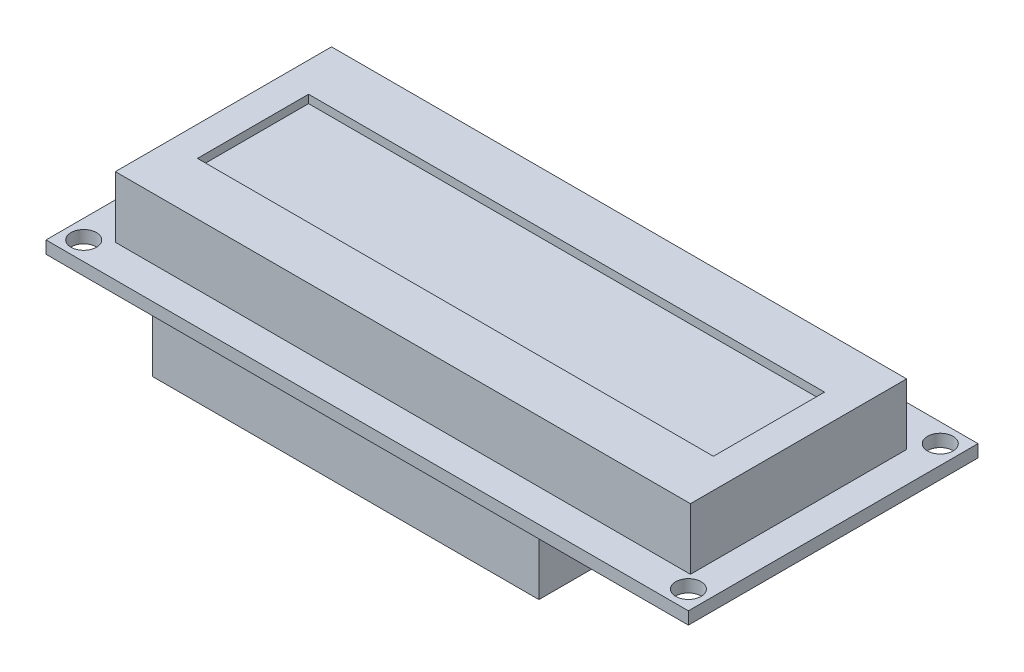
ISO-10303-21;
HEADER;
FILE_DESCRIPTION(('STEP AP214'),'2;1');
FILE_NAME('part.step','',(''),(''),'','','');
FILE_SCHEMA(('AUTOMOTIVE_DESIGN { 1 0 10303 214 1 1 1 1 }'));
ENDSEC;
DATA;
#1=APPLICATION_CONTEXT('core data for automotive mechanical design processes');
#2=APPLICATION_PROTOCOL_DEFINITION('international standard','automotive_design',2000,#1);
#3=PRODUCT_CONTEXT('',#1,'mechanical');
#4=PRODUCT('Part','Part','',(#3));
#5=PRODUCT_RELATED_PRODUCT_CATEGORY('part','',(#4));
#6=PRODUCT_DEFINITION_FORMATION('','',#4);
#7=PRODUCT_DEFINITION_CONTEXT('part definition',#1,'design');
#8=PRODUCT_DEFINITION('design','',#6,#7);
#9=PRODUCT_DEFINITION_SHAPE('','',#8);
#10=(LENGTH_UNIT() NAMED_UNIT(*) SI_UNIT(.MILLI.,.METRE.));
#11=(NAMED_UNIT(*) PLANE_ANGLE_UNIT() SI_UNIT($,.RADIAN.));
#12=(NAMED_UNIT(*) SI_UNIT($,.STERADIAN.) SOLID_ANGLE_UNIT());
#13=UNCERTAINTY_MEASURE_WITH_UNIT(LENGTH_MEASURE(1.E-05),#10,'distance_accuracy_value','');
#14=(GEOMETRIC_REPRESENTATION_CONTEXT(3) GLOBAL_UNCERTAINTY_ASSIGNED_CONTEXT((#13)) GLOBAL_UNIT_ASSIGNED_CONTEXT((#10,
#11,#12)) REPRESENTATION_CONTEXT('',''));
#15=CARTESIAN_POINT('',(0.,0.,0.));
#16=DIRECTION('',(0.,0.,1.));
#17=DIRECTION('',(1.,0.,0.));
#18=AXIS2_PLACEMENT_3D('',#15,#16,#17);
#19=CARTESIAN_POINT('',(0.,-13.462,0.));
#20=DIRECTION('',(0.,-1.,0.));
#21=DIRECTION('',(0.,0.,-1.));
#22=AXIS2_PLACEMENT_3D('',#19,#20,#21);
#23=PLANE('',#22);
#24=DIRECTION('',(0.,0.,1.));
#25=VECTOR('',#24,1.);
#26=CARTESIAN_POINT('',(54.483,-13.462,-35.56));
#27=LINE('',#26,#25);
#28=CARTESIAN_POINT('',(54.483,-13.462,-35.56));
#29=VERTEX_POINT('',#28);
#30=CARTESIAN_POINT('',(54.483,-13.462,-6.90880000000001));
#31=VERTEX_POINT('',#30);
#32=EDGE_CURVE('E304',#29,#31,#27,.T.);
#33=ORIENTED_EDGE('',*,*,#32,.T.);
#34=DIRECTION('',(-1.,0.,0.));
#35=VECTOR('',#34,1.);
#36=CARTESIAN_POINT('',(54.483,-13.462,-6.90880000000001));
#37=LINE('',#36,#35);
#38=CARTESIAN_POINT('',(6.35,-13.462,-6.90880000000001));
#39=VERTEX_POINT('',#38);
#40=EDGE_CURVE('E307',#31,#39,#37,.T.);
#41=ORIENTED_EDGE('',*,*,#40,.T.);
#42=DIRECTION('',(0.,0.,-1.));
#43=VECTOR('',#42,1.);
#44=CARTESIAN_POINT('',(6.35,-13.462,-35.56));
#45=LINE('',#44,#43);
#46=CARTESIAN_POINT('',(6.35,-13.462,-35.56));
#47=VERTEX_POINT('',#46);
#48=EDGE_CURVE('E310',#39,#47,#45,.T.);
#49=ORIENTED_EDGE('',*,*,#48,.T.);
#50=DIRECTION('',(1.,0.,0.));
#51=VECTOR('',#50,1.);
#52=CARTESIAN_POINT('',(54.483,-13.462,-35.56));
#53=LINE('',#52,#51);
#54=EDGE_CURVE('E312',#47,#29,#53,.T.);
#55=ORIENTED_EDGE('',*,*,#54,.T.);
#56=EDGE_LOOP('',(#33,#41,#49,#55));
#57=FACE_BOUND('',#56,.T.);
#58=DIRECTION('',(1.,0.,0.));
#59=VECTOR('',#58,1.);
#60=CARTESIAN_POINT('',(8.6995,-13.462,-18.9611));
#61=LINE('',#60,#59);
#62=CARTESIAN_POINT('',(8.0645,-13.462,-18.9611));
#63=VERTEX_POINT('',#62);
#64=CARTESIAN_POINT('',(8.6995,-13.462,-18.9611));
#65=VERTEX_POINT('',#64);
#66=EDGE_CURVE('E288',#63,#65,#61,.T.);
#67=ORIENTED_EDGE('',*,*,#66,.F.);
#68=DIRECTION('',(0.,0.,-1.));
#69=VECTOR('',#68,1.);
#70=CARTESIAN_POINT('',(8.0645,-13.462,-18.9611));
#71=LINE('',#70,#69);
#72=CARTESIAN_POINT('',(8.0645,-13.462,-18.3261));
#73=VERTEX_POINT('',#72);
#74=EDGE_CURVE('E274',#73,#63,#71,.T.);
#75=ORIENTED_EDGE('',*,*,#74,.F.);
#76=DIRECTION('',(-1.,0.,0.));
#77=VECTOR('',#76,1.);
#78=CARTESIAN_POINT('',(8.6995,-13.462,-18.3261));
#79=LINE('',#78,#77);
#80=CARTESIAN_POINT('',(8.6995,-13.462,-18.3261));
#81=VERTEX_POINT('',#80);
#82=EDGE_CURVE('E279',#81,#73,#79,.T.);
#83=ORIENTED_EDGE('',*,*,#82,.F.);
#84=DIRECTION('',(0.,0.,1.));
#85=VECTOR('',#84,1.);
#86=CARTESIAN_POINT('',(8.6995,-13.462,-18.9611));
#87=LINE('',#86,#85);
#88=EDGE_CURVE('E290',#65,#81,#87,.T.);
#89=ORIENTED_EDGE('',*,*,#88,.F.);
#90=EDGE_LOOP('',(#67,#75,#83,#89));
#91=FACE_BOUND('',#90,.T.);
#92=DIRECTION('',(1.,0.,0.));
#93=VECTOR('',#92,1.);
#94=CARTESIAN_POINT('',(8.69950000000003,-13.462,-21.5011));
#95=LINE('',#94,#93);
#96=CARTESIAN_POINT('',(8.06450000000003,-13.462,-21.5011));
#97=VERTEX_POINT('',#96);
#98=CARTESIAN_POINT('',(8.69950000000003,-13.462,-21.5011));
#99=VERTEX_POINT('',#98);
#100=EDGE_CURVE('E246',#97,#99,#95,.T.);
#101=ORIENTED_EDGE('',*,*,#100,.F.);
#102=DIRECTION('',(0.,0.,-1.));
#103=VECTOR('',#102,1.);
#104=CARTESIAN_POINT('',(8.06450000000003,-13.462,-21.5011));
#105=LINE('',#104,#103);
#106=CARTESIAN_POINT('',(8.06450000000003,-13.462,-20.8661));
#107=VERTEX_POINT('',#106);
#108=EDGE_CURVE('E243',#107,#97,#105,.T.);
#109=ORIENTED_EDGE('',*,*,#108,.F.);
#110=DIRECTION('',(-1.,0.,0.));
#111=VECTOR('',#110,1.);
#112=CARTESIAN_POINT('',(8.69950000000003,-13.462,-20.8661));
#113=LINE('',#112,#111);
#114=CARTESIAN_POINT('',(8.69950000000003,-13.462,-20.8661));
#115=VERTEX_POINT('',#114);
#116=EDGE_CURVE('E255',#115,#107,#113,.T.);
#117=ORIENTED_EDGE('',*,*,#116,.F.);
#118=DIRECTION('',(0.,0.,1.));
#119=VECTOR('',#118,1.);
#120=CARTESIAN_POINT('',(8.69950000000003,-13.462,-21.5011));
#121=LINE('',#120,#119);
#122=EDGE_CURVE('E263',#99,#115,#121,.T.);
#123=ORIENTED_EDGE('',*,*,#122,.F.);
#124=EDGE_LOOP('',(#101,#109,#117,#123));
#125=FACE_BOUND('',#124,.T.);
#126=DIRECTION('',(1.,0.,0.));
#127=VECTOR('',#126,1.);
#128=CARTESIAN_POINT('',(8.69950000000006,-13.462,-24.0411));
#129=LINE('',#128,#127);
#130=CARTESIAN_POINT('',(8.06450000000006,-13.462,-24.0411));
#131=VERTEX_POINT('',#130);
#132=CARTESIAN_POINT('',(8.69950000000006,-13.462,-24.0411));
#133=VERTEX_POINT('',#132);
#134=EDGE_CURVE('E855',#131,#133,#129,.T.);
#135=ORIENTED_EDGE('',*,*,#134,.F.);
#136=DIRECTION('',(0.,0.,-1.));
#137=VECTOR('',#136,1.);
#138=CARTESIAN_POINT('',(8.06450000000006,-13.462,-24.0411));
#139=LINE('',#138,#137);
#140=CARTESIAN_POINT('',(8.06450000000006,-13.462,-23.4061));
#141=VERTEX_POINT('',#140);
#142=EDGE_CURVE('E241',#141,#131,#139,.T.);
#143=ORIENTED_EDGE('',*,*,#142,.F.);
#144=DIRECTION('',(-1.,0.,0.));
#145=VECTOR('',#144,1.);
#146=CARTESIAN_POINT('',(8.69950000000006,-13.462,-23.4061));
#147=LINE('',#146,#145);
#148=CARTESIAN_POINT('',(8.69950000000006,-13.462,-23.4061));
#149=VERTEX_POINT('',#148);
#150=EDGE_CURVE('E237',#149,#141,#147,.T.);
#151=ORIENTED_EDGE('',*,*,#150,.F.);
#152=DIRECTION('',(0.,0.,1.));
#153=VECTOR('',#152,1.);
#154=CARTESIAN_POINT('',(8.69950000000006,-13.462,-24.0411));
#155=LINE('',#154,#153);
#156=EDGE_CURVE('E852',#133,#149,#155,.T.);
#157=ORIENTED_EDGE('',*,*,#156,.F.);
#158=EDGE_LOOP('',(#135,#143,#151,#157));
#159=FACE_BOUND('',#158,.T.);
#160=ADVANCED_FACE('F32',(#57,#91,#125,#159),#23,.T.);
#161=CARTESIAN_POINT('',(0.,0.,0.));
#162=DIRECTION('',(0.,-1.,0.));
#163=DIRECTION('',(0.,0.,-1.));
#164=AXIS2_PLACEMENT_3D('',#161,#162,#163);
#165=PLANE('',#164);
#166=CARTESIAN_POINT('',(77.6604999999999,0.,-33.7185));
#167=DIRECTION('',(0.,1.,0.));
#168=DIRECTION('',(0.,0.,1.));
#169=AXIS2_PLACEMENT_3D('',#166,#167,#168);
#170=CIRCLE('',#169,1.58749999999999);
#171=CARTESIAN_POINT('',(77.6604999999999,0.,-32.131));
#172=VERTEX_POINT('',#171);
#173=EDGE_CURVE('E401',#172,#172,#170,.T.);
#174=ORIENTED_EDGE('',*,*,#173,.T.);
#175=EDGE_LOOP('',(#174));
#176=FACE_BOUND('',#175,.T.);
#177=CARTESIAN_POINT('',(2.3495,0.,-2.3495));
#178=DIRECTION('',(0.,1.,0.));
#179=DIRECTION('',(0.,0.,1.));
#180=AXIS2_PLACEMENT_3D('',#177,#178,#179);
#181=CIRCLE('',#180,1.5875);
#182=CARTESIAN_POINT('',(2.3495,0.,-0.761999999999999));
#183=VERTEX_POINT('',#182);
#184=EDGE_CURVE('E413',#183,#183,#181,.T.);
#185=ORIENTED_EDGE('',*,*,#184,.T.);
#186=EDGE_LOOP('',(#185));
#187=FACE_BOUND('',#186,.T.);
#188=DIRECTION('',(0.,0.,1.));
#189=VECTOR('',#188,1.);
#190=CARTESIAN_POINT('',(0.,0.,0.));
#191=LINE('',#190,#189);
#192=CARTESIAN_POINT('',(0.,0.,-36.068));
#193=VERTEX_POINT('',#192);
#194=CARTESIAN_POINT('',(0.,0.,0.));
#195=VERTEX_POINT('',#194);
#196=EDGE_CURVE('E419',#193,#195,#191,.T.);
#197=ORIENTED_EDGE('',*,*,#196,.F.);
#198=DIRECTION('',(-1.,0.,0.));
#199=VECTOR('',#198,1.);
#200=CARTESIAN_POINT('',(0.,0.,-36.068));
#201=LINE('',#200,#199);
#202=CARTESIAN_POINT('',(80.01,0.,-36.068));
#203=VERTEX_POINT('',#202);
#204=EDGE_CURVE('E426',#203,#193,#201,.T.);
#205=ORIENTED_EDGE('',*,*,#204,.F.);
#206=DIRECTION('',(0.,0.,-1.));
#207=VECTOR('',#206,1.);
#208=CARTESIAN_POINT('',(80.01,0.,0.));
#209=LINE('',#208,#207);
#210=CARTESIAN_POINT('',(80.01,0.,0.));
#211=VERTEX_POINT('',#210);
#212=EDGE_CURVE('E437',#211,#203,#209,.T.);
#213=ORIENTED_EDGE('',*,*,#212,.F.);
#214=DIRECTION('',(1.,0.,0.));
#215=VECTOR('',#214,1.);
#216=CARTESIAN_POINT('',(0.,0.,0.));
#217=LINE('',#216,#215);
#218=EDGE_CURVE('E435',#195,#211,#217,.T.);
#219=ORIENTED_EDGE('',*,*,#218,.F.);
#220=EDGE_LOOP('',(#197,#205,#213,#219));
#221=FACE_BOUND('',#220,.T.);
#222=CARTESIAN_POINT('',(77.6605,0.,-2.3495));
#223=DIRECTION('',(0.,1.,0.));
#224=DIRECTION('',(0.,0.,1.));
#225=AXIS2_PLACEMENT_3D('',#222,#223,#224);
#226=CIRCLE('',#225,1.5875);
#227=CARTESIAN_POINT('',(77.6605,0.,-0.762000000000001));
#228=VERTEX_POINT('',#227);
#229=EDGE_CURVE('E407',#228,#228,#226,.T.);
#230=ORIENTED_EDGE('',*,*,#229,.T.);
#231=EDGE_LOOP('',(#230));
#232=FACE_BOUND('',#231,.T.);
#233=CARTESIAN_POINT('',(2.34949999999989,0.,-33.7185));
#234=DIRECTION('',(0.,1.,0.));
#235=DIRECTION('',(0.,0.,1.));
#236=AXIS2_PLACEMENT_3D('',#233,#234,#235);
#237=CIRCLE('',#236,1.5875);
#238=CARTESIAN_POINT('',(2.34949999999989,0.,-32.131));
#239=VERTEX_POINT('',#238);
#240=EDGE_CURVE('E397',#239,#239,#237,.T.);
#241=ORIENTED_EDGE('',*,*,#240,.T.);
#242=EDGE_LOOP('',(#241));
#243=FACE_BOUND('',#242,.T.);
#244=DIRECTION('',(-1.,0.,0.));
#245=VECTOR('',#244,1.);
#246=CARTESIAN_POINT('',(54.483,0.,-6.90880000000001));
#247=LINE('',#246,#245);
#248=CARTESIAN_POINT('',(54.483,0.,-6.90880000000001));
#249=VERTEX_POINT('',#248);
#250=CARTESIAN_POINT('',(6.35,0.,-6.90880000000001));
#251=VERTEX_POINT('',#250);
#252=EDGE_CURVE('E317',#249,#251,#247,.T.);
#253=ORIENTED_EDGE('',*,*,#252,.F.);
#254=DIRECTION('',(0.,0.,1.));
#255=VECTOR('',#254,1.);
#256=CARTESIAN_POINT('',(54.483,0.,-35.56));
#257=LINE('',#256,#255);
#258=CARTESIAN_POINT('',(54.483,0.,-35.56));
#259=VERTEX_POINT('',#258);
#260=EDGE_CURVE('E303',#259,#249,#257,.T.);
#261=ORIENTED_EDGE('',*,*,#260,.F.);
#262=DIRECTION('',(1.,0.,0.));
#263=VECTOR('',#262,1.);
#264=CARTESIAN_POINT('',(54.483,0.,-35.56));
#265=LINE('',#264,#263);
#266=CARTESIAN_POINT('',(6.35,0.,-35.56));
#267=VERTEX_POINT('',#266);
#268=EDGE_CURVE('E308',#267,#259,#265,.T.);
#269=ORIENTED_EDGE('',*,*,#268,.F.);
#270=DIRECTION('',(0.,0.,-1.));
#271=VECTOR('',#270,1.);
#272=CARTESIAN_POINT('',(6.35,0.,-35.56));
#273=LINE('',#272,#271);
#274=EDGE_CURVE('E319',#251,#267,#273,.T.);
#275=ORIENTED_EDGE('',*,*,#274,.F.);
#276=EDGE_LOOP('',(#253,#261,#269,#275));
#277=FACE_BOUND('',#276,.T.);
#278=ADVANCED_FACE('F455',(#176,#187,#221,#232,#243,#277),#165,.T.);
#279=CARTESIAN_POINT('',(0.,1.5494,0.));
#280=DIRECTION('',(0.,-1.,0.));
#281=DIRECTION('',(0.,0.,-1.));
#282=AXIS2_PLACEMENT_3D('',#279,#280,#281);
#283=PLANE('',#282);
#284=CARTESIAN_POINT('',(2.34949999999989,1.5494,-33.7185));
#285=DIRECTION('',(0.,1.,0.));
#286=DIRECTION('',(0.,0.,1.));
#287=AXIS2_PLACEMENT_3D('',#284,#285,#286);
#288=CIRCLE('',#287,1.5875);
#289=CARTESIAN_POINT('',(2.34949999999989,1.5494,-32.131));
#290=VERTEX_POINT('',#289);
#291=EDGE_CURVE('E398',#290,#290,#288,.T.);
#292=ORIENTED_EDGE('',*,*,#291,.F.);
#293=EDGE_LOOP('',(#292));
#294=FACE_BOUND('',#293,.T.);
#295=CARTESIAN_POINT('',(77.6604999999999,1.5494,-33.7185));
#296=DIRECTION('',(0.,1.,0.));
#297=DIRECTION('',(0.,0.,1.));
#298=AXIS2_PLACEMENT_3D('',#295,#296,#297);
#299=CIRCLE('',#298,1.58749999999999);
#300=CARTESIAN_POINT('',(77.6604999999999,1.5494,-32.131));
#301=VERTEX_POINT('',#300);
#302=EDGE_CURVE('E404',#301,#301,#299,.T.);
#303=ORIENTED_EDGE('',*,*,#302,.F.);
#304=EDGE_LOOP('',(#303));
#305=FACE_BOUND('',#304,.T.);
#306=CARTESIAN_POINT('',(77.6605,1.5494,-2.3495));
#307=DIRECTION('',(0.,1.,0.));
#308=DIRECTION('',(0.,0.,1.));
#309=AXIS2_PLACEMENT_3D('',#306,#307,#308);
#310=CIRCLE('',#309,1.5875);
#311=CARTESIAN_POINT('',(77.6605,1.5494,-0.762000000000001));
#312=VERTEX_POINT('',#311);
#313=EDGE_CURVE('E410',#312,#312,#310,.T.);
#314=ORIENTED_EDGE('',*,*,#313,.F.);
#315=EDGE_LOOP('',(#314));
#316=FACE_BOUND('',#315,.T.);
#317=CARTESIAN_POINT('',(2.3495,1.5494,-2.3495));
#318=DIRECTION('',(0.,1.,0.));
#319=DIRECTION('',(0.,0.,1.));
#320=AXIS2_PLACEMENT_3D('',#317,#318,#319);
#321=CIRCLE('',#320,1.5875);
#322=CARTESIAN_POINT('',(2.3495,1.5494,-0.761999999999999));
#323=VERTEX_POINT('',#322);
#324=EDGE_CURVE('E416',#323,#323,#321,.T.);
#325=ORIENTED_EDGE('',*,*,#324,.F.);
#326=EDGE_LOOP('',(#325));
#327=FACE_BOUND('',#326,.T.);
#328=DIRECTION('',(0.,0.,1.));
#329=VECTOR('',#328,1.);
#330=CARTESIAN_POINT('',(0.,1.5494,0.));
#331=LINE('',#330,#329);
#332=CARTESIAN_POINT('',(0.,1.5494,-36.068));
#333=VERTEX_POINT('',#332);
#334=CARTESIAN_POINT('',(0.,1.5494,0.));
#335=VERTEX_POINT('',#334);
#336=EDGE_CURVE('E422',#333,#335,#331,.T.);
#337=ORIENTED_EDGE('',*,*,#336,.T.);
#338=DIRECTION('',(1.,0.,0.));
#339=VECTOR('',#338,1.);
#340=CARTESIAN_POINT('',(0.,1.5494,0.));
#341=LINE('',#340,#339);
#342=CARTESIAN_POINT('',(80.01,1.5494,0.));
#343=VERTEX_POINT('',#342);
#344=EDGE_CURVE('E425',#335,#343,#341,.T.);
#345=ORIENTED_EDGE('',*,*,#344,.T.);
#346=DIRECTION('',(0.,0.,-1.));
#347=VECTOR('',#346,1.);
#348=CARTESIAN_POINT('',(80.01,1.5494,0.));
#349=LINE('',#348,#347);
#350=CARTESIAN_POINT('',(80.01,1.5494,-36.068));
#351=VERTEX_POINT('',#350);
#352=EDGE_CURVE('E428',#343,#351,#349,.T.);
#353=ORIENTED_EDGE('',*,*,#352,.T.);
#354=DIRECTION('',(-1.,0.,0.));
#355=VECTOR('',#354,1.);
#356=CARTESIAN_POINT('',(0.,1.5494,-36.068));
#357=LINE('',#356,#355);
#358=EDGE_CURVE('E430',#351,#333,#357,.T.);
#359=ORIENTED_EDGE('',*,*,#358,.T.);
#360=EDGE_LOOP('',(#337,#345,#353,#359));
#361=FACE_BOUND('',#360,.T.);
#362=DIRECTION('',(0.,0.,1.));
#363=VECTOR('',#362,1.);
#364=CARTESIAN_POINT('',(4.572,1.5494,-4.064));
#365=LINE('',#364,#363);
#366=CARTESIAN_POINT('',(4.572,1.5494,-30.988));
#367=VERTEX_POINT('',#366);
#368=CARTESIAN_POINT('',(4.572,1.5494,-4.064));
#369=VERTEX_POINT('',#368);
#370=EDGE_CURVE('E358',#367,#369,#365,.T.);
#371=ORIENTED_EDGE('',*,*,#370,.F.);
#372=DIRECTION('',(-1.,0.,0.));
#373=VECTOR('',#372,1.);
#374=CARTESIAN_POINT('',(4.572,1.5494,-30.988));
#375=LINE('',#374,#373);
#376=CARTESIAN_POINT('',(76.2,1.5494,-30.988));
#377=VERTEX_POINT('',#376);
#378=EDGE_CURVE('E369',#377,#367,#375,.T.);
#379=ORIENTED_EDGE('',*,*,#378,.F.);
#380=DIRECTION('',(0.,0.,-1.));
#381=VECTOR('',#380,1.);
#382=CARTESIAN_POINT('',(76.2,1.5494,-4.064));
#383=LINE('',#382,#381);
#384=CARTESIAN_POINT('',(76.2,1.5494,-4.064));
#385=VERTEX_POINT('',#384);
#386=EDGE_CURVE('E381',#385,#377,#383,.T.);
#387=ORIENTED_EDGE('',*,*,#386,.F.);
#388=DIRECTION('',(1.,0.,0.));
#389=VECTOR('',#388,1.);
#390=CARTESIAN_POINT('',(4.572,1.5494,-4.064));
#391=LINE('',#390,#389);
#392=EDGE_CURVE('E378',#369,#385,#391,.T.);
#393=ORIENTED_EDGE('',*,*,#392,.F.);
#394=EDGE_LOOP('',(#371,#379,#387,#393));
#395=FACE_BOUND('',#394,.T.);
#396=ADVANCED_FACE('F465',(#294,#305,#316,#327,#361,#395),#283,.F.);
#397=CARTESIAN_POINT('',(0.,1.5494,0.));
#398=DIRECTION('',(1.,0.,0.));
#399=DIRECTION('',(0.,0.,-1.));
#400=AXIS2_PLACEMENT_3D('',#397,#398,#399);
#401=PLANE('',#400);
#402=ORIENTED_EDGE('',*,*,#196,.T.);
#403=DIRECTION('',(0.,-1.,0.));
#404=VECTOR('',#403,1.);
#405=CARTESIAN_POINT('',(0.,1.5494,0.));
#406=LINE('',#405,#404);
#407=EDGE_CURVE('E11',#335,#195,#406,.T.);
#408=ORIENTED_EDGE('',*,*,#407,.F.);
#409=ORIENTED_EDGE('',*,*,#336,.F.);
#410=DIRECTION('',(0.,-1.,0.));
#411=VECTOR('',#410,1.);
#412=CARTESIAN_POINT('',(0.,1.5494,-36.068));
#413=LINE('',#412,#411);
#414=EDGE_CURVE('E432',#333,#193,#413,.T.);
#415=ORIENTED_EDGE('',*,*,#414,.T.);
#416=EDGE_LOOP('',(#402,#408,#409,#415));
#417=FACE_BOUND('',#416,.T.);
#418=ADVANCED_FACE('F34',(#417),#401,.F.);
#419=CARTESIAN_POINT('',(0.,1.5494,0.));
#420=DIRECTION('',(0.,0.,-1.));
#421=DIRECTION('',(-1.,0.,0.));
#422=AXIS2_PLACEMENT_3D('',#419,#420,#421);
#423=PLANE('',#422);
#424=ORIENTED_EDGE('',*,*,#218,.T.);
#425=DIRECTION('',(0.,-1.,0.));
#426=VECTOR('',#425,1.);
#427=CARTESIAN_POINT('',(80.01,1.5494,0.));
#428=LINE('',#427,#426);
#429=EDGE_CURVE('E40',#343,#211,#428,.T.);
#430=ORIENTED_EDGE('',*,*,#429,.F.);
#431=ORIENTED_EDGE('',*,*,#344,.F.);
#432=ORIENTED_EDGE('',*,*,#407,.T.);
#433=EDGE_LOOP('',(#424,#430,#431,#432));
#434=FACE_BOUND('',#433,.T.);
#435=ADVANCED_FACE('F467',(#434),#423,.F.);
#436=CARTESIAN_POINT('',(80.01,1.5494,0.));
#437=DIRECTION('',(-1.,0.,0.));
#438=DIRECTION('',(0.,0.,1.));
#439=AXIS2_PLACEMENT_3D('',#436,#437,#438);
#440=PLANE('',#439);
#441=ORIENTED_EDGE('',*,*,#212,.T.);
#442=DIRECTION('',(0.,-1.,0.));
#443=VECTOR('',#442,1.);
#444=CARTESIAN_POINT('',(80.01,1.5494,-36.068));
#445=LINE('',#444,#443);
#446=EDGE_CURVE('E442',#351,#203,#445,.T.);
#447=ORIENTED_EDGE('',*,*,#446,.F.);
#448=ORIENTED_EDGE('',*,*,#352,.F.);
#449=ORIENTED_EDGE('',*,*,#429,.T.);
#450=EDGE_LOOP('',(#441,#447,#448,#449));
#451=FACE_BOUND('',#450,.T.);
#452=ADVANCED_FACE('F449',(#451),#440,.F.);
#453=CARTESIAN_POINT('',(0.,1.5494,-36.068));
#454=DIRECTION('',(0.,0.,1.));
#455=DIRECTION('',(1.,0.,0.));
#456=AXIS2_PLACEMENT_3D('',#453,#454,#455);
#457=PLANE('',#456);
#458=ORIENTED_EDGE('',*,*,#204,.T.);
#459=ORIENTED_EDGE('',*,*,#414,.F.);
#460=ORIENTED_EDGE('',*,*,#358,.F.);
#461=ORIENTED_EDGE('',*,*,#446,.T.);
#462=EDGE_LOOP('',(#458,#459,#460,#461));
#463=FACE_BOUND('',#462,.T.);
#464=ADVANCED_FACE('F459',(#463),#457,.F.);
#465=CARTESIAN_POINT('',(2.3495,1.5494,-2.3495));
#466=DIRECTION('',(0.,-1.,0.));
#467=DIRECTION('',(0.,0.,-1.));
#468=AXIS2_PLACEMENT_3D('',#465,#466,#467);
#469=CYLINDRICAL_SURFACE('',#468,1.5875);
#470=ORIENTED_EDGE('',*,*,#324,.T.);
#471=EDGE_LOOP('',(#470));
#472=FACE_BOUND('',#471,.T.);
#473=ORIENTED_EDGE('',*,*,#184,.F.);
#474=EDGE_LOOP('',(#473));
#475=FACE_BOUND('',#474,.T.);
#476=ADVANCED_FACE('F554',(#472,#475),#469,.F.);
#477=CARTESIAN_POINT('',(77.6605,1.5494,-2.3495));
#478=DIRECTION('',(0.,-1.,0.));
#479=DIRECTION('',(0.,0.,-1.));
#480=AXIS2_PLACEMENT_3D('',#477,#478,#479);
#481=CYLINDRICAL_SURFACE('',#480,1.5875);
#482=ORIENTED_EDGE('',*,*,#313,.T.);
#483=EDGE_LOOP('',(#482));
#484=FACE_BOUND('',#483,.T.);
#485=ORIENTED_EDGE('',*,*,#229,.F.);
#486=EDGE_LOOP('',(#485));
#487=FACE_BOUND('',#486,.T.);
#488=ADVANCED_FACE('F550',(#484,#487),#481,.F.);
#489=CARTESIAN_POINT('',(77.6604999999999,1.5494,-33.7185));
#490=DIRECTION('',(0.,-1.,0.));
#491=DIRECTION('',(0.,0.,-1.));
#492=AXIS2_PLACEMENT_3D('',#489,#490,#491);
#493=CYLINDRICAL_SURFACE('',#492,1.58749999999999);
#494=ORIENTED_EDGE('',*,*,#302,.T.);
#495=EDGE_LOOP('',(#494));
#496=FACE_BOUND('',#495,.T.);
#497=ORIENTED_EDGE('',*,*,#173,.F.);
#498=EDGE_LOOP('',(#497));
#499=FACE_BOUND('',#498,.T.);
#500=ADVANCED_FACE('F546',(#496,#499),#493,.F.);
#501=CARTESIAN_POINT('',(2.34949999999989,1.5494,-33.7185));
#502=DIRECTION('',(0.,-1.,0.));
#503=DIRECTION('',(0.,0.,-1.));
#504=AXIS2_PLACEMENT_3D('',#501,#502,#503);
#505=CYLINDRICAL_SURFACE('',#504,1.5875);
#506=ORIENTED_EDGE('',*,*,#291,.T.);
#507=EDGE_LOOP('',(#506));
#508=FACE_BOUND('',#507,.T.);
#509=ORIENTED_EDGE('',*,*,#240,.F.);
#510=EDGE_LOOP('',(#509));
#511=FACE_BOUND('',#510,.T.);
#512=ADVANCED_FACE('F542',(#508,#511),#505,.F.);
#513=CARTESIAN_POINT('',(4.572,9.1694,-4.064));
#514=DIRECTION('',(1.,0.,0.));
#515=DIRECTION('',(0.,0.,-1.));
#516=AXIS2_PLACEMENT_3D('',#513,#514,#515);
#517=PLANE('',#516);
#518=ORIENTED_EDGE('',*,*,#370,.T.);
#519=DIRECTION('',(0.,-1.,0.));
#520=VECTOR('',#519,1.);
#521=CARTESIAN_POINT('',(4.572,9.1694,-4.064));
#522=LINE('',#521,#520);
#523=CARTESIAN_POINT('',(4.572,9.1694,-4.064));
#524=VERTEX_POINT('',#523);
#525=EDGE_CURVE('E394',#524,#369,#522,.T.);
#526=ORIENTED_EDGE('',*,*,#525,.F.);
#527=DIRECTION('',(0.,0.,1.));
#528=VECTOR('',#527,1.);
#529=CARTESIAN_POINT('',(4.572,9.1694,-4.064));
#530=LINE('',#529,#528);
#531=CARTESIAN_POINT('',(4.572,9.1694,-30.988));
#532=VERTEX_POINT('',#531);
#533=EDGE_CURVE('E365',#532,#524,#530,.T.);
#534=ORIENTED_EDGE('',*,*,#533,.F.);
#535=DIRECTION('',(0.,-1.,0.));
#536=VECTOR('',#535,1.);
#537=CARTESIAN_POINT('',(4.572,9.1694,-30.988));
#538=LINE('',#537,#536);
#539=EDGE_CURVE('E375',#532,#367,#538,.T.);
#540=ORIENTED_EDGE('',*,*,#539,.T.);
#541=EDGE_LOOP('',(#518,#526,#534,#540));
#542=FACE_BOUND('',#541,.T.);
#543=ADVANCED_FACE('F538',(#542),#517,.F.);
#544=CARTESIAN_POINT('',(4.572,9.1694,-4.064));
#545=DIRECTION('',(0.,0.,-1.));
#546=DIRECTION('',(-1.,0.,0.));
#547=AXIS2_PLACEMENT_3D('',#544,#545,#546);
#548=PLANE('',#547);
#549=ORIENTED_EDGE('',*,*,#392,.T.);
#550=DIRECTION('',(0.,-1.,0.));
#551=VECTOR('',#550,1.);
#552=CARTESIAN_POINT('',(76.2,9.1694,-4.064));
#553=LINE('',#552,#551);
#554=CARTESIAN_POINT('',(76.2,9.1694,-4.064));
#555=VERTEX_POINT('',#554);
#556=EDGE_CURVE('E391',#555,#385,#553,.T.);
#557=ORIENTED_EDGE('',*,*,#556,.F.);
#558=DIRECTION('',(1.,0.,0.));
#559=VECTOR('',#558,1.);
#560=CARTESIAN_POINT('',(4.572,9.1694,-4.064));
#561=LINE('',#560,#559);
#562=EDGE_CURVE('E368',#524,#555,#561,.T.);
#563=ORIENTED_EDGE('',*,*,#562,.F.);
#564=ORIENTED_EDGE('',*,*,#525,.T.);
#565=EDGE_LOOP('',(#549,#557,#563,#564));
#566=FACE_BOUND('',#565,.T.);
#567=ADVANCED_FACE('F534',(#566),#548,.F.);
#568=CARTESIAN_POINT('',(76.2,9.1694,-4.064));
#569=DIRECTION('',(-1.,0.,0.));
#570=DIRECTION('',(0.,0.,1.));
#571=AXIS2_PLACEMENT_3D('',#568,#569,#570);
#572=PLANE('',#571);
#573=ORIENTED_EDGE('',*,*,#386,.T.);
#574=DIRECTION('',(0.,-1.,0.));
#575=VECTOR('',#574,1.);
#576=CARTESIAN_POINT('',(76.2,9.1694,-30.988));
#577=LINE('',#576,#575);
#578=CARTESIAN_POINT('',(76.2,9.1694,-30.988));
#579=VERTEX_POINT('',#578);
#580=EDGE_CURVE('E388',#579,#377,#577,.T.);
#581=ORIENTED_EDGE('',*,*,#580,.F.);
#582=DIRECTION('',(0.,0.,-1.));
#583=VECTOR('',#582,1.);
#584=CARTESIAN_POINT('',(76.2,9.1694,-4.064));
#585=LINE('',#584,#583);
#586=EDGE_CURVE('E371',#555,#579,#585,.T.);
#587=ORIENTED_EDGE('',*,*,#586,.F.);
#588=ORIENTED_EDGE('',*,*,#556,.T.);
#589=EDGE_LOOP('',(#573,#581,#587,#588));
#590=FACE_BOUND('',#589,.T.);
#591=ADVANCED_FACE('F530',(#590),#572,.F.);
#592=CARTESIAN_POINT('',(4.572,9.1694,-30.988));
#593=DIRECTION('',(0.,0.,1.));
#594=DIRECTION('',(1.,0.,0.));
#595=AXIS2_PLACEMENT_3D('',#592,#593,#594);
#596=PLANE('',#595);
#597=ORIENTED_EDGE('',*,*,#378,.T.);
#598=ORIENTED_EDGE('',*,*,#539,.F.);
#599=DIRECTION('',(-1.,0.,0.));
#600=VECTOR('',#599,1.);
#601=CARTESIAN_POINT('',(4.572,9.1694,-30.988));
#602=LINE('',#601,#600);
#603=EDGE_CURVE('E373',#579,#532,#602,.T.);
#604=ORIENTED_EDGE('',*,*,#603,.F.);
#605=ORIENTED_EDGE('',*,*,#580,.T.);
#606=EDGE_LOOP('',(#597,#598,#604,#605));
#607=FACE_BOUND('',#606,.T.);
#608=ADVANCED_FACE('F526',(#607),#596,.F.);
#609=CARTESIAN_POINT('',(0.,9.1694,0.));
#610=DIRECTION('',(0.,-1.,0.));
#611=DIRECTION('',(0.,0.,-1.));
#612=AXIS2_PLACEMENT_3D('',#609,#610,#611);
#613=PLANE('',#612);
#614=DIRECTION('',(1.,0.,0.));
#615=VECTOR('',#614,1.);
#616=CARTESIAN_POINT('',(8.255,9.1694,-10.6045));
#617=LINE('',#616,#615);
#618=CARTESIAN_POINT('',(8.255,9.1694,-10.6045));
#619=VERTEX_POINT('',#618);
#620=CARTESIAN_POINT('',(72.517,9.1694,-10.6045));
#621=VERTEX_POINT('',#620);
#622=EDGE_CURVE('E348',#619,#621,#617,.T.);
#623=ORIENTED_EDGE('',*,*,#622,.F.);
#624=DIRECTION('',(0.,0.,1.));
#625=VECTOR('',#624,1.);
#626=CARTESIAN_POINT('',(8.255,9.1694,-10.6045));
#627=LINE('',#626,#625);
#628=CARTESIAN_POINT('',(8.255,9.1694,-24.4475));
#629=VERTEX_POINT('',#628);
#630=EDGE_CURVE('E332',#629,#619,#627,.T.);
#631=ORIENTED_EDGE('',*,*,#630,.F.);
#632=DIRECTION('',(-1.,0.,0.));
#633=VECTOR('',#632,1.);
#634=CARTESIAN_POINT('',(8.255,9.1694,-24.4475));
#635=LINE('',#634,#633);
#636=CARTESIAN_POINT('',(72.517,9.1694,-24.4475));
#637=VERTEX_POINT('',#636);
#638=EDGE_CURVE('E337',#637,#629,#635,.T.);
#639=ORIENTED_EDGE('',*,*,#638,.F.);
#640=DIRECTION('',(0.,0.,-1.));
#641=VECTOR('',#640,1.);
#642=CARTESIAN_POINT('',(72.517,9.1694,-10.6045));
#643=LINE('',#642,#641);
#644=EDGE_CURVE('E351',#621,#637,#643,.T.);
#645=ORIENTED_EDGE('',*,*,#644,.F.);
#646=EDGE_LOOP('',(#623,#631,#639,#645));
#647=FACE_BOUND('',#646,.T.);
#648=ORIENTED_EDGE('',*,*,#533,.T.);
#649=ORIENTED_EDGE('',*,*,#562,.T.);
#650=ORIENTED_EDGE('',*,*,#586,.T.);
#651=ORIENTED_EDGE('',*,*,#603,.T.);
#652=EDGE_LOOP('',(#648,#649,#650,#651));
#653=FACE_BOUND('',#652,.T.);
#654=ADVANCED_FACE('F522',(#647,#653),#613,.F.);
#655=CARTESIAN_POINT('',(8.255,8.1534,-10.6045));
#656=DIRECTION('',(-1.,0.,0.));
#657=DIRECTION('',(0.,0.,1.));
#658=AXIS2_PLACEMENT_3D('',#655,#656,#657);
#659=PLANE('',#658);
#660=ORIENTED_EDGE('',*,*,#630,.T.);
#661=DIRECTION('',(0.,1.,0.));
#662=VECTOR('',#661,1.);
#663=CARTESIAN_POINT('',(8.255,8.1534,-10.6045));
#664=LINE('',#663,#662);
#665=CARTESIAN_POINT('',(8.255,8.1534,-10.6045));
#666=VERTEX_POINT('',#665);
#667=EDGE_CURVE('E346',#666,#619,#664,.T.);
#668=ORIENTED_EDGE('',*,*,#667,.F.);
#669=DIRECTION('',(0.,0.,1.));
#670=VECTOR('',#669,1.);
#671=CARTESIAN_POINT('',(8.255,8.1534,-10.6045));
#672=LINE('',#671,#670);
#673=CARTESIAN_POINT('',(8.255,8.1534,-24.4475));
#674=VERTEX_POINT('',#673);
#675=EDGE_CURVE('E333',#674,#666,#672,.T.);
#676=ORIENTED_EDGE('',*,*,#675,.F.);
#677=DIRECTION('',(0.,1.,0.));
#678=VECTOR('',#677,1.);
#679=CARTESIAN_POINT('',(8.255,8.1534,-24.4475));
#680=LINE('',#679,#678);
#681=EDGE_CURVE('E356',#674,#629,#680,.T.);
#682=ORIENTED_EDGE('',*,*,#681,.T.);
#683=EDGE_LOOP('',(#660,#668,#676,#682));
#684=FACE_BOUND('',#683,.T.);
#685=ADVANCED_FACE('F512',(#684),#659,.F.);
#686=CARTESIAN_POINT('',(8.255,8.1534,-24.4475));
#687=DIRECTION('',(0.,0.,-1.));
#688=DIRECTION('',(-1.,0.,0.));
#689=AXIS2_PLACEMENT_3D('',#686,#687,#688);
#690=PLANE('',#689);
#691=ORIENTED_EDGE('',*,*,#638,.T.);
#692=ORIENTED_EDGE('',*,*,#681,.F.);
#693=DIRECTION('',(-1.,0.,0.));
#694=VECTOR('',#693,1.);
#695=CARTESIAN_POINT('',(8.255,8.1534,-24.4475));
#696=LINE('',#695,#694);
#697=CARTESIAN_POINT('',(72.517,8.1534,-24.4475));
#698=VERTEX_POINT('',#697);
#699=EDGE_CURVE('E343',#698,#674,#696,.T.);
#700=ORIENTED_EDGE('',*,*,#699,.F.);
#701=DIRECTION('',(0.,1.,0.));
#702=VECTOR('',#701,1.);
#703=CARTESIAN_POINT('',(72.517,8.1534,-24.4475));
#704=LINE('',#703,#702);
#705=EDGE_CURVE('E359',#698,#637,#704,.T.);
#706=ORIENTED_EDGE('',*,*,#705,.T.);
#707=EDGE_LOOP('',(#691,#692,#700,#706));
#708=FACE_BOUND('',#707,.T.);
#709=ADVANCED_FACE('F508',(#708),#690,.F.);
#710=CARTESIAN_POINT('',(72.517,8.1534,-10.6045));
#711=DIRECTION('',(1.,0.,0.));
#712=DIRECTION('',(0.,0.,-1.));
#713=AXIS2_PLACEMENT_3D('',#710,#711,#712);
#714=PLANE('',#713);
#715=ORIENTED_EDGE('',*,*,#644,.T.);
#716=ORIENTED_EDGE('',*,*,#705,.F.);
#717=DIRECTION('',(0.,0.,-1.));
#718=VECTOR('',#717,1.);
#719=CARTESIAN_POINT('',(72.517,8.1534,-10.6045));
#720=LINE('',#719,#718);
#721=CARTESIAN_POINT('',(72.517,8.1534,-10.6045));
#722=VERTEX_POINT('',#721);
#723=EDGE_CURVE('E340',#722,#698,#720,.T.);
#724=ORIENTED_EDGE('',*,*,#723,.F.);
#725=DIRECTION('',(0.,1.,0.));
#726=VECTOR('',#725,1.);
#727=CARTESIAN_POINT('',(72.517,8.1534,-10.6045));
#728=LINE('',#727,#726);
#729=EDGE_CURVE('E361',#722,#621,#728,.T.);
#730=ORIENTED_EDGE('',*,*,#729,.T.);
#731=EDGE_LOOP('',(#715,#716,#724,#730));
#732=FACE_BOUND('',#731,.T.);
#733=ADVANCED_FACE('F511',(#732),#714,.F.);
#734=CARTESIAN_POINT('',(8.255,8.1534,-10.6045));
#735=DIRECTION('',(0.,0.,1.));
#736=DIRECTION('',(1.,0.,0.));
#737=AXIS2_PLACEMENT_3D('',#734,#735,#736);
#738=PLANE('',#737);
#739=ORIENTED_EDGE('',*,*,#622,.T.);
#740=ORIENTED_EDGE('',*,*,#729,.F.);
#741=DIRECTION('',(1.,0.,0.));
#742=VECTOR('',#741,1.);
#743=CARTESIAN_POINT('',(8.255,8.1534,-10.6045));
#744=LINE('',#743,#742);
#745=EDGE_CURVE('E336',#666,#722,#744,.T.);
#746=ORIENTED_EDGE('',*,*,#745,.F.);
#747=ORIENTED_EDGE('',*,*,#667,.T.);
#748=EDGE_LOOP('',(#739,#740,#746,#747));
#749=FACE_BOUND('',#748,.T.);
#750=ADVANCED_FACE('F506',(#749),#738,.F.);
#751=CARTESIAN_POINT('',(0.,8.1534,0.));
#752=DIRECTION('',(0.,-1.,0.));
#753=DIRECTION('',(0.,0.,-1.));
#754=AXIS2_PLACEMENT_3D('',#751,#752,#753);
#755=PLANE('',#754);
#756=ORIENTED_EDGE('',*,*,#675,.T.);
#757=ORIENTED_EDGE('',*,*,#745,.T.);
#758=ORIENTED_EDGE('',*,*,#723,.T.);
#759=ORIENTED_EDGE('',*,*,#699,.T.);
#760=EDGE_LOOP('',(#756,#757,#758,#759));
#761=FACE_BOUND('',#760,.T.);
#762=ADVANCED_FACE('F502',(#761),#755,.F.);
#763=CARTESIAN_POINT('',(54.483,-13.462,-35.56));
#764=DIRECTION('',(-1.,0.,0.));
#765=DIRECTION('',(0.,0.,1.));
#766=AXIS2_PLACEMENT_3D('',#763,#764,#765);
#767=PLANE('',#766);
#768=ORIENTED_EDGE('',*,*,#260,.T.);
#769=DIRECTION('',(0.,1.,0.));
#770=VECTOR('',#769,1.);
#771=CARTESIAN_POINT('',(54.483,-13.462,-6.90880000000001));
#772=LINE('',#771,#770);
#773=EDGE_CURVE('E330',#31,#249,#772,.T.);
#774=ORIENTED_EDGE('',*,*,#773,.F.);
#775=ORIENTED_EDGE('',*,*,#32,.F.);
#776=DIRECTION('',(0.,1.,0.));
#777=VECTOR('',#776,1.);
#778=CARTESIAN_POINT('',(54.483,-13.462,-35.56));
#779=LINE('',#778,#777);
#780=EDGE_CURVE('E314',#29,#259,#779,.T.);
#781=ORIENTED_EDGE('',*,*,#780,.T.);
#782=EDGE_LOOP('',(#768,#774,#775,#781));
#783=FACE_BOUND('',#782,.T.);
#784=ADVANCED_FACE('F498',(#783),#767,.F.);
#785=CARTESIAN_POINT('',(54.483,-13.462,-6.90880000000001));
#786=DIRECTION('',(0.,0.,-1.));
#787=DIRECTION('',(-1.,0.,0.));
#788=AXIS2_PLACEMENT_3D('',#785,#786,#787);
#789=PLANE('',#788);
#790=ORIENTED_EDGE('',*,*,#252,.T.);
#791=DIRECTION('',(0.,1.,0.));
#792=VECTOR('',#791,1.);
#793=CARTESIAN_POINT('',(6.35,-13.462,-6.90880000000001));
#794=LINE('',#793,#792);
#795=EDGE_CURVE('E327',#39,#251,#794,.T.);
#796=ORIENTED_EDGE('',*,*,#795,.F.);
#797=ORIENTED_EDGE('',*,*,#40,.F.);
#798=ORIENTED_EDGE('',*,*,#773,.T.);
#799=EDGE_LOOP('',(#790,#796,#797,#798));
#800=FACE_BOUND('',#799,.T.);
#801=ADVANCED_FACE('F494',(#800),#789,.F.);
#802=CARTESIAN_POINT('',(6.35,-13.462,-35.56));
#803=DIRECTION('',(1.,0.,0.));
#804=DIRECTION('',(0.,0.,-1.));
#805=AXIS2_PLACEMENT_3D('',#802,#803,#804);
#806=PLANE('',#805);
#807=ORIENTED_EDGE('',*,*,#274,.T.);
#808=DIRECTION('',(0.,1.,0.));
#809=VECTOR('',#808,1.);
#810=CARTESIAN_POINT('',(6.35,-13.462,-35.56));
#811=LINE('',#810,#809);
#812=EDGE_CURVE('E325',#47,#267,#811,.T.);
#813=ORIENTED_EDGE('',*,*,#812,.F.);
#814=ORIENTED_EDGE('',*,*,#48,.F.);
#815=ORIENTED_EDGE('',*,*,#795,.T.);
#816=EDGE_LOOP('',(#807,#813,#814,#815));
#817=FACE_BOUND('',#816,.T.);
#818=ADVANCED_FACE('F490',(#817),#806,.F.);
#819=CARTESIAN_POINT('',(54.483,-13.462,-35.56));
#820=DIRECTION('',(0.,0.,1.));
#821=DIRECTION('',(1.,0.,0.));
#822=AXIS2_PLACEMENT_3D('',#819,#820,#821);
#823=PLANE('',#822);
#824=ORIENTED_EDGE('',*,*,#268,.T.);
#825=ORIENTED_EDGE('',*,*,#780,.F.);
#826=ORIENTED_EDGE('',*,*,#54,.F.);
#827=ORIENTED_EDGE('',*,*,#812,.T.);
#828=EDGE_LOOP('',(#824,#825,#826,#827));
#829=FACE_BOUND('',#828,.T.);
#830=ADVANCED_FACE('F487',(#829),#823,.F.);
#831=CARTESIAN_POINT('',(8.0645,-16.002,-18.9611));
#832=DIRECTION('',(1.,0.,0.));
#833=DIRECTION('',(0.,0.,-1.));
#834=AXIS2_PLACEMENT_3D('',#831,#832,#833);
#835=PLANE('',#834);
#836=ORIENTED_EDGE('',*,*,#74,.T.);
#837=DIRECTION('',(0.,1.,0.));
#838=VECTOR('',#837,1.);
#839=CARTESIAN_POINT('',(8.0645,-16.002,-18.9611));
#840=LINE('',#839,#838);
#841=CARTESIAN_POINT('',(8.0645,-16.002,-18.9611));
#842=VERTEX_POINT('',#841);
#843=EDGE_CURVE('E301',#842,#63,#840,.T.);
#844=ORIENTED_EDGE('',*,*,#843,.F.);
#845=DIRECTION('',(0.,0.,-1.));
#846=VECTOR('',#845,1.);
#847=CARTESIAN_POINT('',(8.0645,-16.002,-18.9611));
#848=LINE('',#847,#846);
#849=CARTESIAN_POINT('',(8.0645,-16.002,-18.3261));
#850=VERTEX_POINT('',#849);
#851=EDGE_CURVE('E275',#850,#842,#848,.T.);
#852=ORIENTED_EDGE('',*,*,#851,.F.);
#853=DIRECTION('',(0.,1.,0.));
#854=VECTOR('',#853,1.);
#855=CARTESIAN_POINT('',(8.0645,-16.002,-18.3261));
#856=LINE('',#855,#854);
#857=EDGE_CURVE('E285',#850,#73,#856,.T.);
#858=ORIENTED_EDGE('',*,*,#857,.T.);
#859=EDGE_LOOP('',(#836,#844,#852,#858));
#860=FACE_BOUND('',#859,.T.);
#861=ADVANCED_FACE('F485',(#860),#835,.F.);
#862=CARTESIAN_POINT('',(8.6995,-16.002,-18.9611));
#863=DIRECTION('',(0.,0.,1.));
#864=DIRECTION('',(1.,0.,0.));
#865=AXIS2_PLACEMENT_3D('',#862,#863,#864);
#866=PLANE('',#865);
#867=ORIENTED_EDGE('',*,*,#66,.T.);
#868=DIRECTION('',(0.,1.,0.));
#869=VECTOR('',#868,1.);
#870=CARTESIAN_POINT('',(8.6995,-16.002,-18.9611));
#871=LINE('',#870,#869);
#872=CARTESIAN_POINT('',(8.6995,-16.002,-18.9611));
#873=VERTEX_POINT('',#872);
#874=EDGE_CURVE('E298',#873,#65,#871,.T.);
#875=ORIENTED_EDGE('',*,*,#874,.F.);
#876=DIRECTION('',(1.,0.,0.));
#877=VECTOR('',#876,1.);
#878=CARTESIAN_POINT('',(8.6995,-16.002,-18.9611));
#879=LINE('',#878,#877);
#880=EDGE_CURVE('E278',#842,#873,#879,.T.);
#881=ORIENTED_EDGE('',*,*,#880,.F.);
#882=ORIENTED_EDGE('',*,*,#843,.T.);
#883=EDGE_LOOP('',(#867,#875,#881,#882));
#884=FACE_BOUND('',#883,.T.);
#885=ADVANCED_FACE('F647',(#884),#866,.F.);
#886=CARTESIAN_POINT('',(8.6995,-16.002,-18.9611));
#887=DIRECTION('',(-1.,0.,0.));
#888=DIRECTION('',(0.,0.,1.));
#889=AXIS2_PLACEMENT_3D('',#886,#887,#888);
#890=PLANE('',#889);
#891=ORIENTED_EDGE('',*,*,#88,.T.);
#892=DIRECTION('',(0.,1.,0.));
#893=VECTOR('',#892,1.);
#894=CARTESIAN_POINT('',(8.6995,-16.002,-18.3261));
#895=LINE('',#894,#893);
#896=CARTESIAN_POINT('',(8.6995,-16.002,-18.3261));
#897=VERTEX_POINT('',#896);
#898=EDGE_CURVE('E296',#897,#81,#895,.T.);
#899=ORIENTED_EDGE('',*,*,#898,.F.);
#900=DIRECTION('',(0.,0.,1.));
#901=VECTOR('',#900,1.);
#902=CARTESIAN_POINT('',(8.6995,-16.002,-18.9611));
#903=LINE('',#902,#901);
#904=EDGE_CURVE('E281',#873,#897,#903,.T.);
#905=ORIENTED_EDGE('',*,*,#904,.F.);
#906=ORIENTED_EDGE('',*,*,#874,.T.);
#907=EDGE_LOOP('',(#891,#899,#905,#906));
#908=FACE_BOUND('',#907,.T.);
#909=ADVANCED_FACE('F654',(#908),#890,.F.);
#910=CARTESIAN_POINT('',(8.6995,-16.002,-18.3261));
#911=DIRECTION('',(0.,0.,-1.));
#912=DIRECTION('',(-1.,0.,0.));
#913=AXIS2_PLACEMENT_3D('',#910,#911,#912);
#914=PLANE('',#913);
#915=ORIENTED_EDGE('',*,*,#82,.T.);
#916=ORIENTED_EDGE('',*,*,#857,.F.);
#917=DIRECTION('',(-1.,0.,0.));
#918=VECTOR('',#917,1.);
#919=CARTESIAN_POINT('',(8.6995,-16.002,-18.3261));
#920=LINE('',#919,#918);
#921=EDGE_CURVE('E283',#897,#850,#920,.T.);
#922=ORIENTED_EDGE('',*,*,#921,.F.);
#923=ORIENTED_EDGE('',*,*,#898,.T.);
#924=EDGE_LOOP('',(#915,#916,#922,#923));
#925=FACE_BOUND('',#924,.T.);
#926=ADVANCED_FACE('F661',(#925),#914,.F.);
#927=CARTESIAN_POINT('',(0.,-16.002,0.));
#928=DIRECTION('',(0.,-1.,0.));
#929=DIRECTION('',(0.,0.,-1.));
#930=AXIS2_PLACEMENT_3D('',#927,#928,#929);
#931=PLANE('',#930);
#932=ORIENTED_EDGE('',*,*,#851,.T.);
#933=ORIENTED_EDGE('',*,*,#880,.T.);
#934=ORIENTED_EDGE('',*,*,#904,.T.);
#935=ORIENTED_EDGE('',*,*,#921,.T.);
#936=EDGE_LOOP('',(#932,#933,#934,#935));
#937=FACE_BOUND('',#936,.T.);
#938=ADVANCED_FACE('F669',(#937),#931,.T.);
#939=CARTESIAN_POINT('',(8.06450000000003,-16.002,-21.5011));
#940=DIRECTION('',(1.,0.,0.));
#941=DIRECTION('',(0.,0.,-1.));
#942=AXIS2_PLACEMENT_3D('',#939,#940,#941);
#943=PLANE('',#942);
#944=ORIENTED_EDGE('',*,*,#108,.T.);
#945=DIRECTION('',(0.,1.,0.));
#946=VECTOR('',#945,1.);
#947=CARTESIAN_POINT('',(8.06450000000003,-16.002,-21.5011));
#948=LINE('',#947,#946);
#949=CARTESIAN_POINT('',(8.06450000000003,-16.002,-21.5011));
#950=VERTEX_POINT('',#949);
#951=EDGE_CURVE('E272',#950,#97,#948,.T.);
#952=ORIENTED_EDGE('',*,*,#951,.F.);
#953=DIRECTION('',(0.,0.,-1.));
#954=VECTOR('',#953,1.);
#955=CARTESIAN_POINT('',(8.06450000000003,-16.002,-21.5011));
#956=LINE('',#955,#954);
#957=CARTESIAN_POINT('',(8.06450000000003,-16.002,-20.8661));
#958=VERTEX_POINT('',#957);
#959=EDGE_CURVE('E251',#958,#950,#956,.T.);
#960=ORIENTED_EDGE('',*,*,#959,.F.);
#961=DIRECTION('',(0.,1.,0.));
#962=VECTOR('',#961,1.);
#963=CARTESIAN_POINT('',(8.06450000000003,-16.002,-20.8661));
#964=LINE('',#963,#962);
#965=EDGE_CURVE('E260',#958,#107,#964,.T.);
#966=ORIENTED_EDGE('',*,*,#965,.T.);
#967=EDGE_LOOP('',(#944,#952,#960,#966));
#968=FACE_BOUND('',#967,.T.);
#969=ADVANCED_FACE('F677',(#968),#943,.F.);
#970=CARTESIAN_POINT('',(8.69950000000003,-16.002,-21.5011));
#971=DIRECTION('',(0.,0.,1.));
#972=DIRECTION('',(1.,0.,0.));
#973=AXIS2_PLACEMENT_3D('',#970,#971,#972);
#974=PLANE('',#973);
#975=ORIENTED_EDGE('',*,*,#100,.T.);
#976=DIRECTION('',(0.,1.,0.));
#977=VECTOR('',#976,1.);
#978=CARTESIAN_POINT('',(8.69950000000003,-16.002,-21.5011));
#979=LINE('',#978,#977);
#980=CARTESIAN_POINT('',(8.69950000000003,-16.002,-21.5011));
#981=VERTEX_POINT('',#980);
#982=EDGE_CURVE('E269',#981,#99,#979,.T.);
#983=ORIENTED_EDGE('',*,*,#982,.F.);
#984=DIRECTION('',(1.,0.,0.));
#985=VECTOR('',#984,1.);
#986=CARTESIAN_POINT('',(8.69950000000003,-16.002,-21.5011));
#987=LINE('',#986,#985);
#988=EDGE_CURVE('E254',#950,#981,#987,.T.);
#989=ORIENTED_EDGE('',*,*,#988,.F.);
#990=ORIENTED_EDGE('',*,*,#951,.T.);
#991=EDGE_LOOP('',(#975,#983,#989,#990));
#992=FACE_BOUND('',#991,.T.);
#993=ADVANCED_FACE('F685',(#992),#974,.F.);
#994=CARTESIAN_POINT('',(8.69950000000003,-16.002,-21.5011));
#995=DIRECTION('',(-1.,0.,0.));
#996=DIRECTION('',(0.,0.,1.));
#997=AXIS2_PLACEMENT_3D('',#994,#995,#996);
#998=PLANE('',#997);
#999=ORIENTED_EDGE('',*,*,#122,.T.);
#1000=DIRECTION('',(0.,1.,0.));
#1001=VECTOR('',#1000,1.);
#1002=CARTESIAN_POINT('',(8.69950000000003,-16.002,-20.8661));
#1003=LINE('',#1002,#1001);
#1004=CARTESIAN_POINT('',(8.69950000000003,-16.002,-20.8661));
#1005=VERTEX_POINT('',#1004);
#1006=EDGE_CURVE('E55',#1005,#115,#1003,.T.);
#1007=ORIENTED_EDGE('',*,*,#1006,.F.);
#1008=DIRECTION('',(0.,0.,1.));
#1009=VECTOR('',#1008,1.);
#1010=CARTESIAN_POINT('',(8.69950000000003,-16.002,-21.5011));
#1011=LINE('',#1010,#1009);
#1012=EDGE_CURVE('E257',#981,#1005,#1011,.T.);
#1013=ORIENTED_EDGE('',*,*,#1012,.F.);
#1014=ORIENTED_EDGE('',*,*,#982,.T.);
#1015=EDGE_LOOP('',(#999,#1007,#1013,#1014));
#1016=FACE_BOUND('',#1015,.T.);
#1017=ADVANCED_FACE('F693',(#1016),#998,.F.);
#1018=CARTESIAN_POINT('',(8.69950000000003,-16.002,-20.8661));
#1019=DIRECTION('',(0.,0.,-1.));
#1020=DIRECTION('',(-1.,0.,0.));
#1021=AXIS2_PLACEMENT_3D('',#1018,#1019,#1020);
#1022=PLANE('',#1021);
#1023=ORIENTED_EDGE('',*,*,#116,.T.);
#1024=ORIENTED_EDGE('',*,*,#965,.F.);
#1025=DIRECTION('',(-1.,0.,0.));
#1026=VECTOR('',#1025,1.);
#1027=CARTESIAN_POINT('',(8.69950000000003,-16.002,-20.8661));
#1028=LINE('',#1027,#1026);
#1029=EDGE_CURVE('E259',#1005,#958,#1028,.T.);
#1030=ORIENTED_EDGE('',*,*,#1029,.F.);
#1031=ORIENTED_EDGE('',*,*,#1006,.T.);
#1032=EDGE_LOOP('',(#1023,#1024,#1030,#1031));
#1033=FACE_BOUND('',#1032,.T.);
#1034=ADVANCED_FACE('F701',(#1033),#1022,.F.);
#1035=CARTESIAN_POINT('',(0.,-16.002,0.));
#1036=DIRECTION('',(0.,-1.,0.));
#1037=DIRECTION('',(0.,0.,-1.));
#1038=AXIS2_PLACEMENT_3D('',#1035,#1036,#1037);
#1039=PLANE('',#1038);
#1040=ORIENTED_EDGE('',*,*,#959,.T.);
#1041=ORIENTED_EDGE('',*,*,#988,.T.);
#1042=ORIENTED_EDGE('',*,*,#1012,.T.);
#1043=ORIENTED_EDGE('',*,*,#1029,.T.);
#1044=EDGE_LOOP('',(#1040,#1041,#1042,#1043));
#1045=FACE_BOUND('',#1044,.T.);
#1046=ADVANCED_FACE('F709',(#1045),#1039,.T.);
#1047=CARTESIAN_POINT('',(8.06450000000006,-16.002,-24.0411));
#1048=DIRECTION('',(1.,0.,0.));
#1049=DIRECTION('',(0.,0.,-1.));
#1050=AXIS2_PLACEMENT_3D('',#1047,#1048,#1049);
#1051=PLANE('',#1050);
#1052=ORIENTED_EDGE('',*,*,#142,.T.);
#1053=DIRECTION('',(0.,1.,0.));
#1054=VECTOR('',#1053,1.);
#1055=CARTESIAN_POINT('',(8.06450000000006,-16.002,-24.0411));
#1056=LINE('',#1055,#1054);
#1057=CARTESIAN_POINT('',(8.06450000000006,-16.002,-24.0411));
#1058=VERTEX_POINT('',#1057);
#1059=EDGE_CURVE('E222',#1058,#131,#1056,.T.);
#1060=ORIENTED_EDGE('',*,*,#1059,.F.);
#1061=DIRECTION('',(0.,0.,-1.));
#1062=VECTOR('',#1061,1.);
#1063=CARTESIAN_POINT('',(8.06450000000006,-16.002,-24.0411));
#1064=LINE('',#1063,#1062);
#1065=CARTESIAN_POINT('',(8.06450000000006,-16.002,-23.4061));
#1066=VERTEX_POINT('',#1065);
#1067=EDGE_CURVE('E229',#1066,#1058,#1064,.T.);
#1068=ORIENTED_EDGE('',*,*,#1067,.F.);
#1069=DIRECTION('',(0.,1.,0.));
#1070=VECTOR('',#1069,1.);
#1071=CARTESIAN_POINT('',(8.06450000000006,-16.002,-23.4061));
#1072=LINE('',#1071,#1070);
#1073=EDGE_CURVE('E849',#1066,#141,#1072,.T.);
#1074=ORIENTED_EDGE('',*,*,#1073,.T.);
#1075=EDGE_LOOP('',(#1052,#1060,#1068,#1074));
#1076=FACE_BOUND('',#1075,.T.);
#1077=ADVANCED_FACE('F239',(#1076),#1051,.F.);
#1078=CARTESIAN_POINT('',(8.69950000000006,-16.002,-24.0411));
#1079=DIRECTION('',(0.,0.,1.));
#1080=DIRECTION('',(1.,0.,0.));
#1081=AXIS2_PLACEMENT_3D('',#1078,#1079,#1080);
#1082=PLANE('',#1081);
#1083=ORIENTED_EDGE('',*,*,#134,.T.);
#1084=DIRECTION('',(0.,1.,0.));
#1085=VECTOR('',#1084,1.);
#1086=CARTESIAN_POINT('',(8.69950000000006,-16.002,-24.0411));
#1087=LINE('',#1086,#1085);
#1088=CARTESIAN_POINT('',(8.69950000000006,-16.002,-24.0411));
#1089=VERTEX_POINT('',#1088);
#1090=EDGE_CURVE('E225',#1089,#133,#1087,.T.);
#1091=ORIENTED_EDGE('',*,*,#1090,.F.);
#1092=DIRECTION('',(1.,0.,0.));
#1093=VECTOR('',#1092,1.);
#1094=CARTESIAN_POINT('',(8.69950000000006,-16.002,-24.0411));
#1095=LINE('',#1094,#1093);
#1096=EDGE_CURVE('E218',#1058,#1089,#1095,.T.);
#1097=ORIENTED_EDGE('',*,*,#1096,.F.);
#1098=ORIENTED_EDGE('',*,*,#1059,.T.);
#1099=EDGE_LOOP('',(#1083,#1091,#1097,#1098));
#1100=FACE_BOUND('',#1099,.T.);
#1101=ADVANCED_FACE('F220',(#1100),#1082,.F.);
#1102=CARTESIAN_POINT('',(8.69950000000006,-16.002,-24.0411));
#1103=DIRECTION('',(-1.,0.,0.));
#1104=DIRECTION('',(0.,0.,1.));
#1105=AXIS2_PLACEMENT_3D('',#1102,#1103,#1104);
#1106=PLANE('',#1105);
#1107=ORIENTED_EDGE('',*,*,#156,.T.);
#1108=DIRECTION('',(0.,1.,0.));
#1109=VECTOR('',#1108,1.);
#1110=CARTESIAN_POINT('',(8.69950000000006,-16.002,-23.4061));
#1111=LINE('',#1110,#1109);
#1112=CARTESIAN_POINT('',(8.69950000000006,-16.002,-23.4061));
#1113=VERTEX_POINT('',#1112);
#1114=EDGE_CURVE('E47',#1113,#149,#1111,.T.);
#1115=ORIENTED_EDGE('',*,*,#1114,.F.);
#1116=DIRECTION('',(0.,0.,1.));
#1117=VECTOR('',#1116,1.);
#1118=CARTESIAN_POINT('',(8.69950000000006,-16.002,-24.0411));
#1119=LINE('',#1118,#1117);
#1120=EDGE_CURVE('E228',#1089,#1113,#1119,.T.);
#1121=ORIENTED_EDGE('',*,*,#1120,.F.);
#1122=ORIENTED_EDGE('',*,*,#1090,.T.);
#1123=EDGE_LOOP('',(#1107,#1115,#1121,#1122));
#1124=FACE_BOUND('',#1123,.T.);
#1125=ADVANCED_FACE('F729',(#1124),#1106,.F.);
#1126=CARTESIAN_POINT('',(8.69950000000006,-16.002,-23.4061));
#1127=DIRECTION('',(0.,0.,-1.));
#1128=DIRECTION('',(-1.,0.,0.));
#1129=AXIS2_PLACEMENT_3D('',#1126,#1127,#1128);
#1130=PLANE('',#1129);
#1131=ORIENTED_EDGE('',*,*,#150,.T.);
#1132=ORIENTED_EDGE('',*,*,#1073,.F.);
#1133=DIRECTION('',(-1.,0.,0.));
#1134=VECTOR('',#1133,1.);
#1135=CARTESIAN_POINT('',(8.69950000000006,-16.002,-23.4061));
#1136=LINE('',#1135,#1134);
#1137=EDGE_CURVE('E233',#1113,#1066,#1136,.T.);
#1138=ORIENTED_EDGE('',*,*,#1137,.F.);
#1139=ORIENTED_EDGE('',*,*,#1114,.T.);
#1140=EDGE_LOOP('',(#1131,#1132,#1138,#1139));
#1141=FACE_BOUND('',#1140,.T.);
#1142=ADVANCED_FACE('F736',(#1141),#1130,.F.);
#1143=CARTESIAN_POINT('',(0.,-16.002,0.));
#1144=DIRECTION('',(0.,-1.,0.));
#1145=DIRECTION('',(0.,0.,-1.));
#1146=AXIS2_PLACEMENT_3D('',#1143,#1144,#1145);
#1147=PLANE('',#1146);
#1148=ORIENTED_EDGE('',*,*,#1067,.T.);
#1149=ORIENTED_EDGE('',*,*,#1096,.T.);
#1150=ORIENTED_EDGE('',*,*,#1120,.T.);
#1151=ORIENTED_EDGE('',*,*,#1137,.T.);
#1152=EDGE_LOOP('',(#1148,#1149,#1150,#1151));
#1153=FACE_BOUND('',#1152,.T.);
#1154=ADVANCED_FACE('F232',(#1153),#1147,.T.);
#1155=CLOSED_SHELL('',(#160,#278,#396,#418,#435,#452,#464,#476,#488,#500,#512,#543,#567,#591,
#608,#654,#685,#709,#733,#750,#762,#784,#801,#818,#830,#861,#885,#909,#926,#938,#969,#993,#1017,
#1034,#1046,#1077,#1101,#1125,#1142,#1154));
#1156=MANIFOLD_SOLID_BREP('B2',#1155);
#1157=ADVANCED_BREP_SHAPE_REPRESENTATION('',(#18,#1156),#14);
#1158=SHAPE_DEFINITION_REPRESENTATION(#9,#1157);
ENDSEC;
END-ISO-10303-21;
